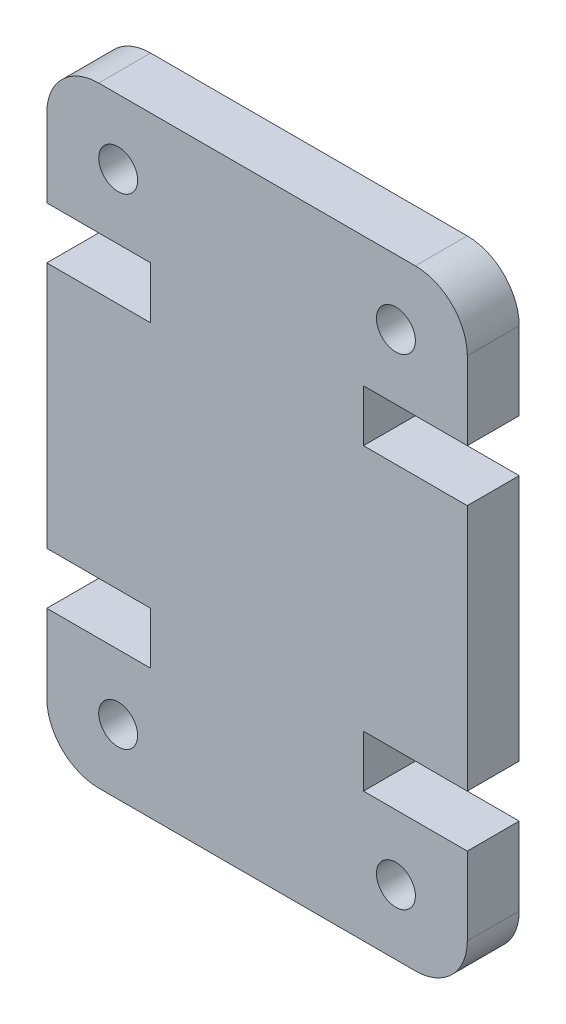
ISO-10303-21;
HEADER;
FILE_DESCRIPTION(('STEP AP214'),'2;1');
FILE_NAME('part.step','',(''),(''),'','','');
FILE_SCHEMA(('AUTOMOTIVE_DESIGN { 1 0 10303 214 1 1 1 1 }'));
ENDSEC;
DATA;
#1=APPLICATION_CONTEXT('core data for automotive mechanical design processes');
#2=APPLICATION_PROTOCOL_DEFINITION('international standard','automotive_design',2000,#1);
#3=PRODUCT_CONTEXT('',#1,'mechanical');
#4=PRODUCT('Part','Part','',(#3));
#5=PRODUCT_RELATED_PRODUCT_CATEGORY('part','',(#4));
#6=PRODUCT_DEFINITION_FORMATION('','',#4);
#7=PRODUCT_DEFINITION_CONTEXT('part definition',#1,'design');
#8=PRODUCT_DEFINITION('design','',#6,#7);
#9=PRODUCT_DEFINITION_SHAPE('','',#8);
#10=(LENGTH_UNIT() NAMED_UNIT(*) SI_UNIT(.MILLI.,.METRE.));
#11=(NAMED_UNIT(*) PLANE_ANGLE_UNIT() SI_UNIT($,.RADIAN.));
#12=(NAMED_UNIT(*) SI_UNIT($,.STERADIAN.) SOLID_ANGLE_UNIT());
#13=UNCERTAINTY_MEASURE_WITH_UNIT(LENGTH_MEASURE(1.E-05),#10,'distance_accuracy_value','');
#14=(GEOMETRIC_REPRESENTATION_CONTEXT(3) GLOBAL_UNCERTAINTY_ASSIGNED_CONTEXT((#13)) GLOBAL_UNIT_ASSIGNED_CONTEXT((#10,
#11,#12)) REPRESENTATION_CONTEXT('',''));
#15=CARTESIAN_POINT('',(0.,0.,0.));
#16=DIRECTION('',(0.,0.,1.));
#17=DIRECTION('',(1.,0.,0.));
#18=AXIS2_PLACEMENT_3D('',#15,#16,#17);
#19=CARTESIAN_POINT('',(14.2,2.,2.));
#20=DIRECTION('',(0.,0.,-1.));
#21=DIRECTION('',(-1.,0.,0.));
#22=AXIS2_PLACEMENT_3D('',#19,#20,#21);
#23=PLANE('',#22);
#24=CARTESIAN_POINT('',(13.4499999999986,21.0250000000001,2.));
#25=DIRECTION('',(0.,0.,1.));
#26=DIRECTION('',(1.,0.,0.));
#27=AXIS2_PLACEMENT_3D('',#24,#25,#26);
#28=CIRCLE('',#27,0.750000000000004);
#29=CARTESIAN_POINT('',(14.1999999999986,21.0250000000001,2.));
#30=VERTEX_POINT('',#29);
#31=EDGE_CURVE('E448',#30,#30,#28,.T.);
#32=ORIENTED_EDGE('',*,*,#31,.F.);
#33=EDGE_LOOP('',(#32));
#34=FACE_BOUND('',#33,.T.);
#35=CARTESIAN_POINT('',(13.4499999999986,2.4999999999999,2.));
#36=DIRECTION('',(0.,0.,1.));
#37=DIRECTION('',(-1.,0.,0.));
#38=AXIS2_PLACEMENT_3D('',#35,#36,#37);
#39=CIRCLE('',#38,0.750000000000004);
#40=CARTESIAN_POINT('',(12.6999999999986,2.4999999999999,2.));
#41=VERTEX_POINT('',#40);
#42=EDGE_CURVE('E230',#41,#41,#39,.T.);
#43=ORIENTED_EDGE('',*,*,#42,.F.);
#44=EDGE_LOOP('',(#43));
#45=FACE_BOUND('',#44,.T.);
#46=CARTESIAN_POINT('',(14.2,2.,2.));
#47=DIRECTION('',(0.,0.,1.));
#48=DIRECTION('',(-1.,0.,0.));
#49=AXIS2_PLACEMENT_3D('',#46,#47,#48);
#50=CIRCLE('',#49,2.);
#51=CARTESIAN_POINT('',(14.2,0.,2.));
#52=VERTEX_POINT('',#51);
#53=CARTESIAN_POINT('',(16.2,2.,2.));
#54=VERTEX_POINT('',#53);
#55=EDGE_CURVE('E273',#52,#54,#50,.T.);
#56=ORIENTED_EDGE('',*,*,#55,.T.);
#57=DIRECTION('',(0.,1.,0.));
#58=VECTOR('',#57,1.);
#59=CARTESIAN_POINT('',(16.2,5.00000000000014,2.));
#60=LINE('',#59,#58);
#61=CARTESIAN_POINT('',(16.2,5.00000000000014,2.));
#62=VERTEX_POINT('',#61);
#63=EDGE_CURVE('E141',#54,#62,#60,.T.);
#64=ORIENTED_EDGE('',*,*,#63,.T.);
#65=DIRECTION('',(-1.,0.,0.));
#66=VECTOR('',#65,1.);
#67=CARTESIAN_POINT('',(12.2,5.00000000000014,2.));
#68=LINE('',#67,#66);
#69=CARTESIAN_POINT('',(12.2,5.00000000000014,2.));
#70=VERTEX_POINT('',#69);
#71=EDGE_CURVE('E336',#62,#70,#68,.T.);
#72=ORIENTED_EDGE('',*,*,#71,.T.);
#73=DIRECTION('',(0.,1.,0.));
#74=VECTOR('',#73,1.);
#75=CARTESIAN_POINT('',(12.2,7.00000000000014,2.));
#76=LINE('',#75,#74);
#77=CARTESIAN_POINT('',(12.2,7.00000000000014,2.));
#78=VERTEX_POINT('',#77);
#79=EDGE_CURVE('E355',#70,#78,#76,.T.);
#80=ORIENTED_EDGE('',*,*,#79,.T.);
#81=DIRECTION('',(1.,0.,0.));
#82=VECTOR('',#81,1.);
#83=CARTESIAN_POINT('',(16.2,7.00000000000014,2.));
#84=LINE('',#83,#82);
#85=CARTESIAN_POINT('',(16.2,7.00000000000014,2.));
#86=VERTEX_POINT('',#85);
#87=EDGE_CURVE('E352',#78,#86,#84,.T.);
#88=ORIENTED_EDGE('',*,*,#87,.T.);
#89=DIRECTION('',(0.,1.,0.));
#90=VECTOR('',#89,1.);
#91=CARTESIAN_POINT('',(16.2,7.00000000000014,2.));
#92=LINE('',#91,#90);
#93=CARTESIAN_POINT('',(16.2,16.5249999999999,2.));
#94=VERTEX_POINT('',#93);
#95=EDGE_CURVE('E354',#86,#94,#92,.T.);
#96=ORIENTED_EDGE('',*,*,#95,.T.);
#97=DIRECTION('',(-1.,0.,0.));
#98=VECTOR('',#97,1.);
#99=CARTESIAN_POINT('',(16.2,16.5249999999999,2.));
#100=LINE('',#99,#98);
#101=CARTESIAN_POINT('',(12.2,16.5249999999999,2.));
#102=VERTEX_POINT('',#101);
#103=EDGE_CURVE('E357',#94,#102,#100,.T.);
#104=ORIENTED_EDGE('',*,*,#103,.T.);
#105=DIRECTION('',(0.,1.,0.));
#106=VECTOR('',#105,1.);
#107=CARTESIAN_POINT('',(12.2,16.5249999999999,2.));
#108=LINE('',#107,#106);
#109=CARTESIAN_POINT('',(12.2,18.5249999999999,2.));
#110=VERTEX_POINT('',#109);
#111=EDGE_CURVE('E363',#102,#110,#108,.T.);
#112=ORIENTED_EDGE('',*,*,#111,.T.);
#113=DIRECTION('',(1.,0.,0.));
#114=VECTOR('',#113,1.);
#115=CARTESIAN_POINT('',(12.2,18.5249999999999,2.));
#116=LINE('',#115,#114);
#117=CARTESIAN_POINT('',(16.2,18.5249999999999,2.));
#118=VERTEX_POINT('',#117);
#119=EDGE_CURVE('E365',#110,#118,#116,.T.);
#120=ORIENTED_EDGE('',*,*,#119,.T.);
#121=DIRECTION('',(0.,1.,0.));
#122=VECTOR('',#121,1.);
#123=CARTESIAN_POINT('',(16.2,18.5249999999999,2.));
#124=LINE('',#123,#122);
#125=CARTESIAN_POINT('',(16.2,21.525,2.));
#126=VERTEX_POINT('',#125);
#127=EDGE_CURVE('E367',#118,#126,#124,.T.);
#128=ORIENTED_EDGE('',*,*,#127,.T.);
#129=CARTESIAN_POINT('',(14.2,21.525,2.));
#130=DIRECTION('',(0.,0.,1.));
#131=DIRECTION('',(1.,0.,0.));
#132=AXIS2_PLACEMENT_3D('',#129,#130,#131);
#133=CIRCLE('',#132,2.);
#134=CARTESIAN_POINT('',(14.2,23.525,2.));
#135=VERTEX_POINT('',#134);
#136=EDGE_CURVE('E369',#126,#135,#133,.T.);
#137=ORIENTED_EDGE('',*,*,#136,.T.);
#138=DIRECTION('',(-1.,0.,0.));
#139=VECTOR('',#138,1.);
#140=CARTESIAN_POINT('',(1.99999999999999,23.525,2.));
#141=LINE('',#140,#139);
#142=CARTESIAN_POINT('',(1.99999999999999,23.525,2.));
#143=VERTEX_POINT('',#142);
#144=EDGE_CURVE('E371',#135,#143,#141,.T.);
#145=ORIENTED_EDGE('',*,*,#144,.T.);
#146=CARTESIAN_POINT('',(2.,21.525,2.));
#147=DIRECTION('',(0.,0.,1.));
#148=DIRECTION('',(-1.,0.,0.));
#149=AXIS2_PLACEMENT_3D('',#146,#147,#148);
#150=CIRCLE('',#149,2.);
#151=CARTESIAN_POINT('',(0.,21.525,2.));
#152=VERTEX_POINT('',#151);
#153=EDGE_CURVE('E373',#143,#152,#150,.T.);
#154=ORIENTED_EDGE('',*,*,#153,.T.);
#155=DIRECTION('',(0.,-1.,0.));
#156=VECTOR('',#155,1.);
#157=CARTESIAN_POINT('',(0.,18.5249999999999,2.));
#158=LINE('',#157,#156);
#159=CARTESIAN_POINT('',(0.,18.5249999999999,2.));
#160=VERTEX_POINT('',#159);
#161=EDGE_CURVE('E375',#152,#160,#158,.T.);
#162=ORIENTED_EDGE('',*,*,#161,.T.);
#163=DIRECTION('',(1.,0.,0.));
#164=VECTOR('',#163,1.);
#165=CARTESIAN_POINT('',(4.,18.5249999999999,2.));
#166=LINE('',#165,#164);
#167=CARTESIAN_POINT('',(4.,18.5249999999999,2.));
#168=VERTEX_POINT('',#167);
#169=EDGE_CURVE('E377',#160,#168,#166,.T.);
#170=ORIENTED_EDGE('',*,*,#169,.T.);
#171=DIRECTION('',(0.,-1.,0.));
#172=VECTOR('',#171,1.);
#173=CARTESIAN_POINT('',(4.,16.5249999999999,2.));
#174=LINE('',#173,#172);
#175=CARTESIAN_POINT('',(4.,16.5249999999999,2.));
#176=VERTEX_POINT('',#175);
#177=EDGE_CURVE('E379',#168,#176,#174,.T.);
#178=ORIENTED_EDGE('',*,*,#177,.T.);
#179=DIRECTION('',(-1.,0.,0.));
#180=VECTOR('',#179,1.);
#181=CARTESIAN_POINT('',(0.,16.5249999999999,2.));
#182=LINE('',#181,#180);
#183=CARTESIAN_POINT('',(0.,16.5249999999999,2.));
#184=VERTEX_POINT('',#183);
#185=EDGE_CURVE('E381',#176,#184,#182,.T.);
#186=ORIENTED_EDGE('',*,*,#185,.T.);
#187=DIRECTION('',(0.,-1.,0.));
#188=VECTOR('',#187,1.);
#189=CARTESIAN_POINT('',(0.,7.00000000000012,2.));
#190=LINE('',#189,#188);
#191=CARTESIAN_POINT('',(0.,7.00000000000012,2.));
#192=VERTEX_POINT('',#191);
#193=EDGE_CURVE('E383',#184,#192,#190,.T.);
#194=ORIENTED_EDGE('',*,*,#193,.T.);
#195=DIRECTION('',(1.,0.,0.));
#196=VECTOR('',#195,1.);
#197=CARTESIAN_POINT('',(0.,7.00000000000012,2.));
#198=LINE('',#197,#196);
#199=CARTESIAN_POINT('',(4.,7.00000000000014,2.));
#200=VERTEX_POINT('',#199);
#201=EDGE_CURVE('E385',#192,#200,#198,.T.);
#202=ORIENTED_EDGE('',*,*,#201,.T.);
#203=DIRECTION('',(0.,-1.,0.));
#204=VECTOR('',#203,1.);
#205=CARTESIAN_POINT('',(4.,7.00000000000014,2.));
#206=LINE('',#205,#204);
#207=CARTESIAN_POINT('',(4.,5.00000000000014,2.));
#208=VERTEX_POINT('',#207);
#209=EDGE_CURVE('E387',#200,#208,#206,.T.);
#210=ORIENTED_EDGE('',*,*,#209,.T.);
#211=DIRECTION('',(-1.,0.,0.));
#212=VECTOR('',#211,1.);
#213=CARTESIAN_POINT('',(4.,5.00000000000014,2.));
#214=LINE('',#213,#212);
#215=CARTESIAN_POINT('',(0.,5.00000000000014,2.));
#216=VERTEX_POINT('',#215);
#217=EDGE_CURVE('E208',#208,#216,#214,.T.);
#218=ORIENTED_EDGE('',*,*,#217,.T.);
#219=DIRECTION('',(0.,-1.,0.));
#220=VECTOR('',#219,1.);
#221=CARTESIAN_POINT('',(0.,5.00000000000014,2.));
#222=LINE('',#221,#220);
#223=CARTESIAN_POINT('',(0.,2.00000000000002,2.));
#224=VERTEX_POINT('',#223);
#225=EDGE_CURVE('E202',#216,#224,#222,.T.);
#226=ORIENTED_EDGE('',*,*,#225,.T.);
#227=CARTESIAN_POINT('',(2.,2.,2.));
#228=DIRECTION('',(0.,0.,1.));
#229=DIRECTION('',(1.,0.,0.));
#230=AXIS2_PLACEMENT_3D('',#227,#228,#229);
#231=CIRCLE('',#230,2.);
#232=CARTESIAN_POINT('',(2.,0.,2.));
#233=VERTEX_POINT('',#232);
#234=EDGE_CURVE('E206',#224,#233,#231,.T.);
#235=ORIENTED_EDGE('',*,*,#234,.T.);
#236=DIRECTION('',(1.,0.,0.));
#237=VECTOR('',#236,1.);
#238=CARTESIAN_POINT('',(2.,0.,2.));
#239=LINE('',#238,#237);
#240=EDGE_CURVE('E50',#233,#52,#239,.T.);
#241=ORIENTED_EDGE('',*,*,#240,.T.);
#242=EDGE_LOOP('',(#56,#64,#72,#80,#88,#96,#104,#112,#120,#128,#137,#145,#154,#162,#170,#178,
#186,#194,#202,#210,#218,#226,#235,#241));
#243=FACE_BOUND('',#242,.T.);
#244=CARTESIAN_POINT('',(2.75000000000137,21.0250000000001,2.));
#245=DIRECTION('',(0.,0.,1.));
#246=DIRECTION('',(-1.,0.,0.));
#247=AXIS2_PLACEMENT_3D('',#244,#245,#246);
#248=CIRCLE('',#247,0.749999999999999);
#249=CARTESIAN_POINT('',(2.00000000000137,21.0250000000001,2.));
#250=VERTEX_POINT('',#249);
#251=EDGE_CURVE('E454',#250,#250,#248,.T.);
#252=ORIENTED_EDGE('',*,*,#251,.F.);
#253=EDGE_LOOP('',(#252));
#254=FACE_BOUND('',#253,.T.);
#255=CARTESIAN_POINT('',(2.75000000000138,2.4999999999999,2.));
#256=DIRECTION('',(0.,0.,1.));
#257=DIRECTION('',(1.,0.,0.));
#258=AXIS2_PLACEMENT_3D('',#255,#256,#257);
#259=CIRCLE('',#258,0.75);
#260=CARTESIAN_POINT('',(3.50000000000138,2.4999999999999,2.));
#261=VERTEX_POINT('',#260);
#262=EDGE_CURVE('E439',#261,#261,#259,.T.);
#263=ORIENTED_EDGE('',*,*,#262,.F.);
#264=EDGE_LOOP('',(#263));
#265=FACE_BOUND('',#264,.T.);
#266=ADVANCED_FACE('F33',(#34,#45,#243,#254,#265),#23,.F.);
#267=CARTESIAN_POINT('',(14.2,2.,0.));
#268=DIRECTION('',(0.,0.,-1.));
#269=DIRECTION('',(-1.,0.,0.));
#270=AXIS2_PLACEMENT_3D('',#267,#268,#269);
#271=PLANE('',#270);
#272=CARTESIAN_POINT('',(13.4499999999986,21.0250000000001,0.));
#273=DIRECTION('',(0.,0.,1.));
#274=DIRECTION('',(1.,0.,0.));
#275=AXIS2_PLACEMENT_3D('',#272,#273,#274);
#276=CIRCLE('',#275,0.750000000000004);
#277=CARTESIAN_POINT('',(14.1999999999986,21.0250000000001,0.));
#278=VERTEX_POINT('',#277);
#279=EDGE_CURVE('E445',#278,#278,#276,.T.);
#280=ORIENTED_EDGE('',*,*,#279,.T.);
#281=EDGE_LOOP('',(#280));
#282=FACE_BOUND('',#281,.T.);
#283=CARTESIAN_POINT('',(13.4499999999986,2.4999999999999,0.));
#284=DIRECTION('',(0.,0.,1.));
#285=DIRECTION('',(-1.,0.,0.));
#286=AXIS2_PLACEMENT_3D('',#283,#284,#285);
#287=CIRCLE('',#286,0.750000000000004);
#288=CARTESIAN_POINT('',(12.6999999999986,2.4999999999999,0.));
#289=VERTEX_POINT('',#288);
#290=EDGE_CURVE('E457',#289,#289,#287,.T.);
#291=ORIENTED_EDGE('',*,*,#290,.T.);
#292=EDGE_LOOP('',(#291));
#293=FACE_BOUND('',#292,.T.);
#294=CARTESIAN_POINT('',(14.2,2.,0.));
#295=DIRECTION('',(0.,0.,1.));
#296=DIRECTION('',(-1.,0.,0.));
#297=AXIS2_PLACEMENT_3D('',#294,#295,#296);
#298=CIRCLE('',#297,2.);
#299=CARTESIAN_POINT('',(14.2,0.,0.));
#300=VERTEX_POINT('',#299);
#301=CARTESIAN_POINT('',(16.2,2.,0.));
#302=VERTEX_POINT('',#301);
#303=EDGE_CURVE('E226',#300,#302,#298,.T.);
#304=ORIENTED_EDGE('',*,*,#303,.F.);
#305=DIRECTION('',(1.,0.,0.));
#306=VECTOR('',#305,1.);
#307=CARTESIAN_POINT('',(2.,0.,0.));
#308=LINE('',#307,#306);
#309=CARTESIAN_POINT('',(2.,0.,0.));
#310=VERTEX_POINT('',#309);
#311=EDGE_CURVE('E133',#310,#300,#308,.T.);
#312=ORIENTED_EDGE('',*,*,#311,.F.);
#313=CARTESIAN_POINT('',(2.,2.,0.));
#314=DIRECTION('',(0.,0.,1.));
#315=DIRECTION('',(1.,0.,0.));
#316=AXIS2_PLACEMENT_3D('',#313,#314,#315);
#317=CIRCLE('',#316,2.);
#318=CARTESIAN_POINT('',(0.,2.00000000000002,0.));
#319=VERTEX_POINT('',#318);
#320=EDGE_CURVE('E127',#319,#310,#317,.T.);
#321=ORIENTED_EDGE('',*,*,#320,.F.);
#322=DIRECTION('',(0.,-1.,0.));
#323=VECTOR('',#322,1.);
#324=CARTESIAN_POINT('',(0.,5.00000000000014,0.));
#325=LINE('',#324,#323);
#326=CARTESIAN_POINT('',(0.,5.00000000000014,0.));
#327=VERTEX_POINT('',#326);
#328=EDGE_CURVE('E216',#327,#319,#325,.T.);
#329=ORIENTED_EDGE('',*,*,#328,.F.);
#330=DIRECTION('',(-1.,0.,0.));
#331=VECTOR('',#330,1.);
#332=CARTESIAN_POINT('',(4.,5.00000000000014,0.));
#333=LINE('',#332,#331);
#334=CARTESIAN_POINT('',(4.,5.00000000000014,0.));
#335=VERTEX_POINT('',#334);
#336=EDGE_CURVE('E268',#335,#327,#333,.T.);
#337=ORIENTED_EDGE('',*,*,#336,.F.);
#338=DIRECTION('',(0.,-1.,0.));
#339=VECTOR('',#338,1.);
#340=CARTESIAN_POINT('',(4.,7.00000000000014,0.));
#341=LINE('',#340,#339);
#342=CARTESIAN_POINT('',(4.,7.00000000000014,0.));
#343=VERTEX_POINT('',#342);
#344=EDGE_CURVE('E266',#343,#335,#341,.T.);
#345=ORIENTED_EDGE('',*,*,#344,.F.);
#346=DIRECTION('',(1.,0.,0.));
#347=VECTOR('',#346,1.);
#348=CARTESIAN_POINT('',(0.,7.00000000000012,0.));
#349=LINE('',#348,#347);
#350=CARTESIAN_POINT('',(0.,7.00000000000012,0.));
#351=VERTEX_POINT('',#350);
#352=EDGE_CURVE('E264',#351,#343,#349,.T.);
#353=ORIENTED_EDGE('',*,*,#352,.F.);
#354=DIRECTION('',(0.,-1.,0.));
#355=VECTOR('',#354,1.);
#356=CARTESIAN_POINT('',(0.,7.00000000000012,0.));
#357=LINE('',#356,#355);
#358=CARTESIAN_POINT('',(0.,16.5249999999999,0.));
#359=VERTEX_POINT('',#358);
#360=EDGE_CURVE('E262',#359,#351,#357,.T.);
#361=ORIENTED_EDGE('',*,*,#360,.F.);
#362=DIRECTION('',(-1.,0.,0.));
#363=VECTOR('',#362,1.);
#364=CARTESIAN_POINT('',(0.,16.5249999999999,0.));
#365=LINE('',#364,#363);
#366=CARTESIAN_POINT('',(4.,16.5249999999999,0.));
#367=VERTEX_POINT('',#366);
#368=EDGE_CURVE('E260',#367,#359,#365,.T.);
#369=ORIENTED_EDGE('',*,*,#368,.F.);
#370=DIRECTION('',(0.,-1.,0.));
#371=VECTOR('',#370,1.);
#372=CARTESIAN_POINT('',(4.,16.5249999999999,0.));
#373=LINE('',#372,#371);
#374=CARTESIAN_POINT('',(4.,18.5249999999999,0.));
#375=VERTEX_POINT('',#374);
#376=EDGE_CURVE('E258',#375,#367,#373,.T.);
#377=ORIENTED_EDGE('',*,*,#376,.F.);
#378=DIRECTION('',(1.,0.,0.));
#379=VECTOR('',#378,1.);
#380=CARTESIAN_POINT('',(4.,18.5249999999999,0.));
#381=LINE('',#380,#379);
#382=CARTESIAN_POINT('',(0.,18.5249999999999,0.));
#383=VERTEX_POINT('',#382);
#384=EDGE_CURVE('E256',#383,#375,#381,.T.);
#385=ORIENTED_EDGE('',*,*,#384,.F.);
#386=DIRECTION('',(0.,-1.,0.));
#387=VECTOR('',#386,1.);
#388=CARTESIAN_POINT('',(0.,18.5249999999999,0.));
#389=LINE('',#388,#387);
#390=CARTESIAN_POINT('',(0.,21.525,0.));
#391=VERTEX_POINT('',#390);
#392=EDGE_CURVE('E254',#391,#383,#389,.T.);
#393=ORIENTED_EDGE('',*,*,#392,.F.);
#394=CARTESIAN_POINT('',(2.,21.525,0.));
#395=DIRECTION('',(0.,0.,1.));
#396=DIRECTION('',(-1.,0.,0.));
#397=AXIS2_PLACEMENT_3D('',#394,#395,#396);
#398=CIRCLE('',#397,2.);
#399=CARTESIAN_POINT('',(1.99999999999999,23.525,0.));
#400=VERTEX_POINT('',#399);
#401=EDGE_CURVE('E252',#400,#391,#398,.T.);
#402=ORIENTED_EDGE('',*,*,#401,.F.);
#403=DIRECTION('',(-1.,0.,0.));
#404=VECTOR('',#403,1.);
#405=CARTESIAN_POINT('',(1.99999999999999,23.525,0.));
#406=LINE('',#405,#404);
#407=CARTESIAN_POINT('',(14.2,23.525,0.));
#408=VERTEX_POINT('',#407);
#409=EDGE_CURVE('E250',#408,#400,#406,.T.);
#410=ORIENTED_EDGE('',*,*,#409,.F.);
#411=CARTESIAN_POINT('',(14.2,21.525,0.));
#412=DIRECTION('',(0.,0.,1.));
#413=DIRECTION('',(1.,0.,0.));
#414=AXIS2_PLACEMENT_3D('',#411,#412,#413);
#415=CIRCLE('',#414,2.);
#416=CARTESIAN_POINT('',(16.2,21.525,0.));
#417=VERTEX_POINT('',#416);
#418=EDGE_CURVE('E248',#417,#408,#415,.T.);
#419=ORIENTED_EDGE('',*,*,#418,.F.);
#420=DIRECTION('',(0.,1.,0.));
#421=VECTOR('',#420,1.);
#422=CARTESIAN_POINT('',(16.2,18.5249999999999,0.));
#423=LINE('',#422,#421);
#424=CARTESIAN_POINT('',(16.2,18.5249999999999,0.));
#425=VERTEX_POINT('',#424);
#426=EDGE_CURVE('E246',#425,#417,#423,.T.);
#427=ORIENTED_EDGE('',*,*,#426,.F.);
#428=DIRECTION('',(1.,0.,0.));
#429=VECTOR('',#428,1.);
#430=CARTESIAN_POINT('',(12.2,18.5249999999999,0.));
#431=LINE('',#430,#429);
#432=CARTESIAN_POINT('',(12.2,18.5249999999999,0.));
#433=VERTEX_POINT('',#432);
#434=EDGE_CURVE('E244',#433,#425,#431,.T.);
#435=ORIENTED_EDGE('',*,*,#434,.F.);
#436=DIRECTION('',(0.,1.,0.));
#437=VECTOR('',#436,1.);
#438=CARTESIAN_POINT('',(12.2,16.5249999999999,0.));
#439=LINE('',#438,#437);
#440=CARTESIAN_POINT('',(12.2,16.5249999999999,0.));
#441=VERTEX_POINT('',#440);
#442=EDGE_CURVE('E242',#441,#433,#439,.T.);
#443=ORIENTED_EDGE('',*,*,#442,.F.);
#444=DIRECTION('',(-1.,0.,0.));
#445=VECTOR('',#444,1.);
#446=CARTESIAN_POINT('',(16.2,16.5249999999999,0.));
#447=LINE('',#446,#445);
#448=CARTESIAN_POINT('',(16.2,16.5249999999999,0.));
#449=VERTEX_POINT('',#448);
#450=EDGE_CURVE('E240',#449,#441,#447,.T.);
#451=ORIENTED_EDGE('',*,*,#450,.F.);
#452=DIRECTION('',(0.,1.,0.));
#453=VECTOR('',#452,1.);
#454=CARTESIAN_POINT('',(16.2,7.00000000000014,0.));
#455=LINE('',#454,#453);
#456=CARTESIAN_POINT('',(16.2,7.00000000000014,0.));
#457=VERTEX_POINT('',#456);
#458=EDGE_CURVE('E238',#457,#449,#455,.T.);
#459=ORIENTED_EDGE('',*,*,#458,.F.);
#460=DIRECTION('',(1.,0.,0.));
#461=VECTOR('',#460,1.);
#462=CARTESIAN_POINT('',(16.2,7.00000000000014,0.));
#463=LINE('',#462,#461);
#464=CARTESIAN_POINT('',(12.2,7.00000000000014,0.));
#465=VERTEX_POINT('',#464);
#466=EDGE_CURVE('E236',#465,#457,#463,.T.);
#467=ORIENTED_EDGE('',*,*,#466,.F.);
#468=DIRECTION('',(0.,1.,0.));
#469=VECTOR('',#468,1.);
#470=CARTESIAN_POINT('',(12.2,7.00000000000014,0.));
#471=LINE('',#470,#469);
#472=CARTESIAN_POINT('',(12.2,5.00000000000014,0.));
#473=VERTEX_POINT('',#472);
#474=EDGE_CURVE('E234',#473,#465,#471,.T.);
#475=ORIENTED_EDGE('',*,*,#474,.F.);
#476=DIRECTION('',(-1.,0.,0.));
#477=VECTOR('',#476,1.);
#478=CARTESIAN_POINT('',(12.2,5.00000000000014,0.));
#479=LINE('',#478,#477);
#480=CARTESIAN_POINT('',(16.2,5.00000000000014,0.));
#481=VERTEX_POINT('',#480);
#482=EDGE_CURVE('E232',#481,#473,#479,.T.);
#483=ORIENTED_EDGE('',*,*,#482,.F.);
#484=DIRECTION('',(0.,1.,0.));
#485=VECTOR('',#484,1.);
#486=CARTESIAN_POINT('',(16.2,5.00000000000014,0.));
#487=LINE('',#486,#485);
#488=EDGE_CURVE('E229',#302,#481,#487,.T.);
#489=ORIENTED_EDGE('',*,*,#488,.F.);
#490=EDGE_LOOP('',(#304,#312,#321,#329,#337,#345,#353,#361,#369,#377,#385,#393,#402,#410,#419,
#427,#435,#443,#451,#459,#467,#475,#483,#489));
#491=FACE_BOUND('',#490,.T.);
#492=CARTESIAN_POINT('',(2.75000000000137,21.0250000000001,0.));
#493=DIRECTION('',(0.,0.,1.));
#494=DIRECTION('',(-1.,0.,0.));
#495=AXIS2_PLACEMENT_3D('',#492,#493,#494);
#496=CIRCLE('',#495,0.749999999999999);
#497=CARTESIAN_POINT('',(2.00000000000137,21.0250000000001,0.));
#498=VERTEX_POINT('',#497);
#499=EDGE_CURVE('E451',#498,#498,#496,.T.);
#500=ORIENTED_EDGE('',*,*,#499,.T.);
#501=EDGE_LOOP('',(#500));
#502=FACE_BOUND('',#501,.T.);
#503=CARTESIAN_POINT('',(2.75000000000138,2.4999999999999,0.));
#504=DIRECTION('',(0.,0.,1.));
#505=DIRECTION('',(1.,0.,0.));
#506=AXIS2_PLACEMENT_3D('',#503,#504,#505);
#507=CIRCLE('',#506,0.75);
#508=CARTESIAN_POINT('',(3.50000000000138,2.4999999999999,0.));
#509=VERTEX_POINT('',#508);
#510=EDGE_CURVE('E442',#509,#509,#507,.T.);
#511=ORIENTED_EDGE('',*,*,#510,.T.);
#512=EDGE_LOOP('',(#511));
#513=FACE_BOUND('',#512,.T.);
#514=ADVANCED_FACE('F340',(#282,#293,#491,#502,#513),#271,.T.);
#515=CARTESIAN_POINT('',(14.2,2.,2.));
#516=DIRECTION('',(0.,0.,-1.));
#517=DIRECTION('',(-1.,0.,0.));
#518=AXIS2_PLACEMENT_3D('',#515,#516,#517);
#519=CYLINDRICAL_SURFACE('',#518,2.);
#520=ORIENTED_EDGE('',*,*,#303,.T.);
#521=DIRECTION('',(0.,0.,-1.));
#522=VECTOR('',#521,1.);
#523=CARTESIAN_POINT('',(16.2,2.,2.));
#524=LINE('',#523,#522);
#525=EDGE_CURVE('E11',#54,#302,#524,.T.);
#526=ORIENTED_EDGE('',*,*,#525,.F.);
#527=ORIENTED_EDGE('',*,*,#55,.F.);
#528=DIRECTION('',(0.,0.,-1.));
#529=VECTOR('',#528,1.);
#530=CARTESIAN_POINT('',(14.2,0.,2.));
#531=LINE('',#530,#529);
#532=EDGE_CURVE('E222',#52,#300,#531,.T.);
#533=ORIENTED_EDGE('',*,*,#532,.T.);
#534=EDGE_LOOP('',(#520,#526,#527,#533));
#535=FACE_BOUND('',#534,.T.);
#536=ADVANCED_FACE('F35',(#535),#519,.T.);
#537=CARTESIAN_POINT('',(16.2,5.00000000000014,2.));
#538=DIRECTION('',(-1.,0.,0.));
#539=DIRECTION('',(0.,-1.,0.));
#540=AXIS2_PLACEMENT_3D('',#537,#538,#539);
#541=PLANE('',#540);
#542=ORIENTED_EDGE('',*,*,#488,.T.);
#543=DIRECTION('',(0.,0.,-1.));
#544=VECTOR('',#543,1.);
#545=CARTESIAN_POINT('',(16.2,5.00000000000014,2.));
#546=LINE('',#545,#544);
#547=EDGE_CURVE('E42',#62,#481,#546,.T.);
#548=ORIENTED_EDGE('',*,*,#547,.F.);
#549=ORIENTED_EDGE('',*,*,#63,.F.);
#550=ORIENTED_EDGE('',*,*,#525,.T.);
#551=EDGE_LOOP('',(#542,#548,#549,#550));
#552=FACE_BOUND('',#551,.T.);
#553=ADVANCED_FACE('F686',(#552),#541,.F.);
#554=CARTESIAN_POINT('',(12.2,5.00000000000014,2.));
#555=DIRECTION('',(0.,-1.,0.));
#556=DIRECTION('',(0.,0.,-1.));
#557=AXIS2_PLACEMENT_3D('',#554,#555,#556);
#558=PLANE('',#557);
#559=ORIENTED_EDGE('',*,*,#482,.T.);
#560=DIRECTION('',(0.,0.,-1.));
#561=VECTOR('',#560,1.);
#562=CARTESIAN_POINT('',(12.2,5.00000000000014,2.));
#563=LINE('',#562,#561);
#564=EDGE_CURVE('E328',#70,#473,#563,.T.);
#565=ORIENTED_EDGE('',*,*,#564,.F.);
#566=ORIENTED_EDGE('',*,*,#71,.F.);
#567=ORIENTED_EDGE('',*,*,#547,.T.);
#568=EDGE_LOOP('',(#559,#565,#566,#567));
#569=FACE_BOUND('',#568,.T.);
#570=ADVANCED_FACE('F334',(#569),#558,.F.);
#571=CARTESIAN_POINT('',(12.2,7.00000000000014,2.));
#572=DIRECTION('',(-1.,0.,0.));
#573=DIRECTION('',(0.,-1.,0.));
#574=AXIS2_PLACEMENT_3D('',#571,#572,#573);
#575=PLANE('',#574);
#576=ORIENTED_EDGE('',*,*,#474,.T.);
#577=DIRECTION('',(0.,0.,-1.));
#578=VECTOR('',#577,1.);
#579=CARTESIAN_POINT('',(12.2,7.00000000000014,2.));
#580=LINE('',#579,#578);
#581=EDGE_CURVE('E325',#78,#465,#580,.T.);
#582=ORIENTED_EDGE('',*,*,#581,.F.);
#583=ORIENTED_EDGE('',*,*,#79,.F.);
#584=ORIENTED_EDGE('',*,*,#564,.T.);
#585=EDGE_LOOP('',(#576,#582,#583,#584));
#586=FACE_BOUND('',#585,.T.);
#587=ADVANCED_FACE('F346',(#586),#575,.F.);
#588=CARTESIAN_POINT('',(16.2,7.00000000000014,2.));
#589=DIRECTION('',(0.,1.,0.));
#590=DIRECTION('',(-1.,0.,0.));
#591=AXIS2_PLACEMENT_3D('',#588,#589,#590);
#592=PLANE('',#591);
#593=ORIENTED_EDGE('',*,*,#466,.T.);
#594=DIRECTION('',(0.,0.,-1.));
#595=VECTOR('',#594,1.);
#596=CARTESIAN_POINT('',(16.2,7.00000000000014,2.));
#597=LINE('',#596,#595);
#598=EDGE_CURVE('E322',#86,#457,#597,.T.);
#599=ORIENTED_EDGE('',*,*,#598,.F.);
#600=ORIENTED_EDGE('',*,*,#87,.F.);
#601=ORIENTED_EDGE('',*,*,#581,.T.);
#602=EDGE_LOOP('',(#593,#599,#600,#601));
#603=FACE_BOUND('',#602,.T.);
#604=ADVANCED_FACE('F350',(#603),#592,.F.);
#605=CARTESIAN_POINT('',(16.2,7.00000000000014,2.));
#606=DIRECTION('',(-1.,0.,0.));
#607=DIRECTION('',(0.,0.,1.));
#608=AXIS2_PLACEMENT_3D('',#605,#606,#607);
#609=PLANE('',#608);
#610=ORIENTED_EDGE('',*,*,#458,.T.);
#611=DIRECTION('',(0.,0.,-1.));
#612=VECTOR('',#611,1.);
#613=CARTESIAN_POINT('',(16.2,16.5249999999999,2.));
#614=LINE('',#613,#612);
#615=EDGE_CURVE('E319',#94,#449,#614,.T.);
#616=ORIENTED_EDGE('',*,*,#615,.F.);
#617=ORIENTED_EDGE('',*,*,#95,.F.);
#618=ORIENTED_EDGE('',*,*,#598,.T.);
#619=EDGE_LOOP('',(#610,#616,#617,#618));
#620=FACE_BOUND('',#619,.T.);
#621=ADVANCED_FACE('F651',(#620),#609,.F.);
#622=CARTESIAN_POINT('',(16.2,16.5249999999999,2.));
#623=DIRECTION('',(0.,-1.,0.));
#624=DIRECTION('',(1.,0.,0.));
#625=AXIS2_PLACEMENT_3D('',#622,#623,#624);
#626=PLANE('',#625);
#627=ORIENTED_EDGE('',*,*,#450,.T.);
#628=DIRECTION('',(0.,0.,-1.));
#629=VECTOR('',#628,1.);
#630=CARTESIAN_POINT('',(12.2,16.5249999999999,2.));
#631=LINE('',#630,#629);
#632=EDGE_CURVE('E316',#102,#441,#631,.T.);
#633=ORIENTED_EDGE('',*,*,#632,.F.);
#634=ORIENTED_EDGE('',*,*,#103,.F.);
#635=ORIENTED_EDGE('',*,*,#615,.T.);
#636=EDGE_LOOP('',(#627,#633,#634,#635));
#637=FACE_BOUND('',#636,.T.);
#638=ADVANCED_FACE('F641',(#637),#626,.F.);
#639=CARTESIAN_POINT('',(12.2,16.5249999999999,2.));
#640=DIRECTION('',(-1.,0.,0.));
#641=DIRECTION('',(0.,-1.,0.));
#642=AXIS2_PLACEMENT_3D('',#639,#640,#641);
#643=PLANE('',#642);
#644=ORIENTED_EDGE('',*,*,#442,.T.);
#645=DIRECTION('',(0.,0.,-1.));
#646=VECTOR('',#645,1.);
#647=CARTESIAN_POINT('',(12.2,18.5249999999999,2.));
#648=LINE('',#647,#646);
#649=EDGE_CURVE('E313',#110,#433,#648,.T.);
#650=ORIENTED_EDGE('',*,*,#649,.F.);
#651=ORIENTED_EDGE('',*,*,#111,.F.);
#652=ORIENTED_EDGE('',*,*,#632,.T.);
#653=EDGE_LOOP('',(#644,#650,#651,#652));
#654=FACE_BOUND('',#653,.T.);
#655=ADVANCED_FACE('F631',(#654),#643,.F.);
#656=CARTESIAN_POINT('',(12.2,18.5249999999999,2.));
#657=DIRECTION('',(0.,1.,0.));
#658=DIRECTION('',(0.,0.,1.));
#659=AXIS2_PLACEMENT_3D('',#656,#657,#658);
#660=PLANE('',#659);
#661=ORIENTED_EDGE('',*,*,#434,.T.);
#662=DIRECTION('',(0.,0.,-1.));
#663=VECTOR('',#662,1.);
#664=CARTESIAN_POINT('',(16.2,18.5249999999999,2.));
#665=LINE('',#664,#663);
#666=EDGE_CURVE('E310',#118,#425,#665,.T.);
#667=ORIENTED_EDGE('',*,*,#666,.F.);
#668=ORIENTED_EDGE('',*,*,#119,.F.);
#669=ORIENTED_EDGE('',*,*,#649,.T.);
#670=EDGE_LOOP('',(#661,#667,#668,#669));
#671=FACE_BOUND('',#670,.T.);
#672=ADVANCED_FACE('F621',(#671),#660,.F.);
#673=CARTESIAN_POINT('',(16.2,18.5249999999999,2.));
#674=DIRECTION('',(-1.,0.,0.));
#675=DIRECTION('',(0.,-1.,0.));
#676=AXIS2_PLACEMENT_3D('',#673,#674,#675);
#677=PLANE('',#676);
#678=ORIENTED_EDGE('',*,*,#426,.T.);
#679=DIRECTION('',(0.,0.,-1.));
#680=VECTOR('',#679,1.);
#681=CARTESIAN_POINT('',(16.2,21.525,2.));
#682=LINE('',#681,#680);
#683=EDGE_CURVE('E307',#126,#417,#682,.T.);
#684=ORIENTED_EDGE('',*,*,#683,.F.);
#685=ORIENTED_EDGE('',*,*,#127,.F.);
#686=ORIENTED_EDGE('',*,*,#666,.T.);
#687=EDGE_LOOP('',(#678,#684,#685,#686));
#688=FACE_BOUND('',#687,.T.);
#689=ADVANCED_FACE('F611',(#688),#677,.F.);
#690=CARTESIAN_POINT('',(14.2,21.525,2.));
#691=DIRECTION('',(0.,0.,-1.));
#692=DIRECTION('',(-1.,0.,0.));
#693=AXIS2_PLACEMENT_3D('',#690,#691,#692);
#694=CYLINDRICAL_SURFACE('',#693,2.);
#695=ORIENTED_EDGE('',*,*,#418,.T.);
#696=DIRECTION('',(0.,0.,-1.));
#697=VECTOR('',#696,1.);
#698=CARTESIAN_POINT('',(14.2,23.525,2.));
#699=LINE('',#698,#697);
#700=EDGE_CURVE('E304',#135,#408,#699,.T.);
#701=ORIENTED_EDGE('',*,*,#700,.F.);
#702=ORIENTED_EDGE('',*,*,#136,.F.);
#703=ORIENTED_EDGE('',*,*,#683,.T.);
#704=EDGE_LOOP('',(#695,#701,#702,#703));
#705=FACE_BOUND('',#704,.T.);
#706=ADVANCED_FACE('F601',(#705),#694,.T.);
#707=CARTESIAN_POINT('',(1.99999999999999,23.525,2.));
#708=DIRECTION('',(0.,-1.,0.));
#709=DIRECTION('',(0.,0.,-1.));
#710=AXIS2_PLACEMENT_3D('',#707,#708,#709);
#711=PLANE('',#710);
#712=ORIENTED_EDGE('',*,*,#409,.T.);
#713=DIRECTION('',(0.,0.,-1.));
#714=VECTOR('',#713,1.);
#715=CARTESIAN_POINT('',(1.99999999999999,23.525,2.));
#716=LINE('',#715,#714);
#717=EDGE_CURVE('E301',#143,#400,#716,.T.);
#718=ORIENTED_EDGE('',*,*,#717,.F.);
#719=ORIENTED_EDGE('',*,*,#144,.F.);
#720=ORIENTED_EDGE('',*,*,#700,.T.);
#721=EDGE_LOOP('',(#712,#718,#719,#720));
#722=FACE_BOUND('',#721,.T.);
#723=ADVANCED_FACE('F591',(#722),#711,.F.);
#724=CARTESIAN_POINT('',(2.,21.525,2.));
#725=DIRECTION('',(0.,0.,-1.));
#726=DIRECTION('',(-1.,0.,0.));
#727=AXIS2_PLACEMENT_3D('',#724,#725,#726);
#728=CYLINDRICAL_SURFACE('',#727,2.);
#729=ORIENTED_EDGE('',*,*,#401,.T.);
#730=DIRECTION('',(0.,0.,-1.));
#731=VECTOR('',#730,1.);
#732=CARTESIAN_POINT('',(0.,21.525,2.));
#733=LINE('',#732,#731);
#734=EDGE_CURVE('E298',#152,#391,#733,.T.);
#735=ORIENTED_EDGE('',*,*,#734,.F.);
#736=ORIENTED_EDGE('',*,*,#153,.F.);
#737=ORIENTED_EDGE('',*,*,#717,.T.);
#738=EDGE_LOOP('',(#729,#735,#736,#737));
#739=FACE_BOUND('',#738,.T.);
#740=ADVANCED_FACE('F581',(#739),#728,.T.);
#741=CARTESIAN_POINT('',(0.,18.5249999999999,2.));
#742=DIRECTION('',(1.,0.,0.));
#743=DIRECTION('',(0.,1.,0.));
#744=AXIS2_PLACEMENT_3D('',#741,#742,#743);
#745=PLANE('',#744);
#746=ORIENTED_EDGE('',*,*,#392,.T.);
#747=DIRECTION('',(0.,0.,-1.));
#748=VECTOR('',#747,1.);
#749=CARTESIAN_POINT('',(0.,18.5249999999999,2.));
#750=LINE('',#749,#748);
#751=EDGE_CURVE('E295',#160,#383,#750,.T.);
#752=ORIENTED_EDGE('',*,*,#751,.F.);
#753=ORIENTED_EDGE('',*,*,#161,.F.);
#754=ORIENTED_EDGE('',*,*,#734,.T.);
#755=EDGE_LOOP('',(#746,#752,#753,#754));
#756=FACE_BOUND('',#755,.T.);
#757=ADVANCED_FACE('F571',(#756),#745,.F.);
#758=CARTESIAN_POINT('',(4.,18.5249999999999,2.));
#759=DIRECTION('',(0.,1.,0.));
#760=DIRECTION('',(-1.,0.,0.));
#761=AXIS2_PLACEMENT_3D('',#758,#759,#760);
#762=PLANE('',#761);
#763=ORIENTED_EDGE('',*,*,#384,.T.);
#764=DIRECTION('',(0.,0.,-1.));
#765=VECTOR('',#764,1.);
#766=CARTESIAN_POINT('',(4.,18.5249999999999,2.));
#767=LINE('',#766,#765);
#768=EDGE_CURVE('E292',#168,#375,#767,.T.);
#769=ORIENTED_EDGE('',*,*,#768,.F.);
#770=ORIENTED_EDGE('',*,*,#169,.F.);
#771=ORIENTED_EDGE('',*,*,#751,.T.);
#772=EDGE_LOOP('',(#763,#769,#770,#771));
#773=FACE_BOUND('',#772,.T.);
#774=ADVANCED_FACE('F561',(#773),#762,.F.);
#775=CARTESIAN_POINT('',(4.,16.5249999999999,2.));
#776=DIRECTION('',(1.,0.,0.));
#777=DIRECTION('',(0.,0.,-1.));
#778=AXIS2_PLACEMENT_3D('',#775,#776,#777);
#779=PLANE('',#778);
#780=ORIENTED_EDGE('',*,*,#376,.T.);
#781=DIRECTION('',(0.,0.,-1.));
#782=VECTOR('',#781,1.);
#783=CARTESIAN_POINT('',(4.,16.5249999999999,2.));
#784=LINE('',#783,#782);
#785=EDGE_CURVE('E289',#176,#367,#784,.T.);
#786=ORIENTED_EDGE('',*,*,#785,.F.);
#787=ORIENTED_EDGE('',*,*,#177,.F.);
#788=ORIENTED_EDGE('',*,*,#768,.T.);
#789=EDGE_LOOP('',(#780,#786,#787,#788));
#790=FACE_BOUND('',#789,.T.);
#791=ADVANCED_FACE('F551',(#790),#779,.F.);
#792=CARTESIAN_POINT('',(0.,16.5249999999999,2.));
#793=DIRECTION('',(0.,-1.,0.));
#794=DIRECTION('',(1.,0.,0.));
#795=AXIS2_PLACEMENT_3D('',#792,#793,#794);
#796=PLANE('',#795);
#797=ORIENTED_EDGE('',*,*,#368,.T.);
#798=DIRECTION('',(0.,0.,-1.));
#799=VECTOR('',#798,1.);
#800=CARTESIAN_POINT('',(0.,16.5249999999999,2.));
#801=LINE('',#800,#799);
#802=EDGE_CURVE('E286',#184,#359,#801,.T.);
#803=ORIENTED_EDGE('',*,*,#802,.F.);
#804=ORIENTED_EDGE('',*,*,#185,.F.);
#805=ORIENTED_EDGE('',*,*,#785,.T.);
#806=EDGE_LOOP('',(#797,#803,#804,#805));
#807=FACE_BOUND('',#806,.T.);
#808=ADVANCED_FACE('F541',(#807),#796,.F.);
#809=CARTESIAN_POINT('',(0.,7.00000000000012,2.));
#810=DIRECTION('',(1.,0.,0.));
#811=DIRECTION('',(0.,0.,-1.));
#812=AXIS2_PLACEMENT_3D('',#809,#810,#811);
#813=PLANE('',#812);
#814=ORIENTED_EDGE('',*,*,#360,.T.);
#815=DIRECTION('',(0.,0.,-1.));
#816=VECTOR('',#815,1.);
#817=CARTESIAN_POINT('',(0.,7.00000000000012,2.));
#818=LINE('',#817,#816);
#819=EDGE_CURVE('E283',#192,#351,#818,.T.);
#820=ORIENTED_EDGE('',*,*,#819,.F.);
#821=ORIENTED_EDGE('',*,*,#193,.F.);
#822=ORIENTED_EDGE('',*,*,#802,.T.);
#823=EDGE_LOOP('',(#814,#820,#821,#822));
#824=FACE_BOUND('',#823,.T.);
#825=ADVANCED_FACE('F531',(#824),#813,.F.);
#826=CARTESIAN_POINT('',(0.,7.00000000000012,2.));
#827=DIRECTION('',(0.,1.,0.));
#828=DIRECTION('',(-1.,0.,0.));
#829=AXIS2_PLACEMENT_3D('',#826,#827,#828);
#830=PLANE('',#829);
#831=ORIENTED_EDGE('',*,*,#352,.T.);
#832=DIRECTION('',(0.,0.,-1.));
#833=VECTOR('',#832,1.);
#834=CARTESIAN_POINT('',(4.,7.00000000000014,2.));
#835=LINE('',#834,#833);
#836=EDGE_CURVE('E280',#200,#343,#835,.T.);
#837=ORIENTED_EDGE('',*,*,#836,.F.);
#838=ORIENTED_EDGE('',*,*,#201,.F.);
#839=ORIENTED_EDGE('',*,*,#819,.T.);
#840=EDGE_LOOP('',(#831,#837,#838,#839));
#841=FACE_BOUND('',#840,.T.);
#842=ADVANCED_FACE('F522',(#841),#830,.F.);
#843=CARTESIAN_POINT('',(4.,7.00000000000014,2.));
#844=DIRECTION('',(1.,0.,0.));
#845=DIRECTION('',(0.,0.,-1.));
#846=AXIS2_PLACEMENT_3D('',#843,#844,#845);
#847=PLANE('',#846);
#848=ORIENTED_EDGE('',*,*,#344,.T.);
#849=DIRECTION('',(0.,0.,-1.));
#850=VECTOR('',#849,1.);
#851=CARTESIAN_POINT('',(4.,5.00000000000014,2.));
#852=LINE('',#851,#850);
#853=EDGE_CURVE('E277',#208,#335,#852,.T.);
#854=ORIENTED_EDGE('',*,*,#853,.F.);
#855=ORIENTED_EDGE('',*,*,#209,.F.);
#856=ORIENTED_EDGE('',*,*,#836,.T.);
#857=EDGE_LOOP('',(#848,#854,#855,#856));
#858=FACE_BOUND('',#857,.T.);
#859=ADVANCED_FACE('F393',(#858),#847,.F.);
#860=CARTESIAN_POINT('',(4.,5.00000000000014,2.));
#861=DIRECTION('',(0.,-1.,0.));
#862=DIRECTION('',(1.,0.,0.));
#863=AXIS2_PLACEMENT_3D('',#860,#861,#862);
#864=PLANE('',#863);
#865=ORIENTED_EDGE('',*,*,#336,.T.);
#866=DIRECTION('',(0.,0.,-1.));
#867=VECTOR('',#866,1.);
#868=CARTESIAN_POINT('',(0.,5.00000000000014,2.));
#869=LINE('',#868,#867);
#870=EDGE_CURVE('E217',#216,#327,#869,.T.);
#871=ORIENTED_EDGE('',*,*,#870,.F.);
#872=ORIENTED_EDGE('',*,*,#217,.F.);
#873=ORIENTED_EDGE('',*,*,#853,.T.);
#874=EDGE_LOOP('',(#865,#871,#872,#873));
#875=FACE_BOUND('',#874,.T.);
#876=ADVANCED_FACE('F397',(#875),#864,.F.);
#877=CARTESIAN_POINT('',(0.,5.00000000000014,2.));
#878=DIRECTION('',(1.,0.,0.));
#879=DIRECTION('',(0.,0.,-1.));
#880=AXIS2_PLACEMENT_3D('',#877,#878,#879);
#881=PLANE('',#880);
#882=ORIENTED_EDGE('',*,*,#328,.T.);
#883=DIRECTION('',(0.,0.,-1.));
#884=VECTOR('',#883,1.);
#885=CARTESIAN_POINT('',(0.,2.00000000000002,2.));
#886=LINE('',#885,#884);
#887=EDGE_CURVE('E213',#224,#319,#886,.T.);
#888=ORIENTED_EDGE('',*,*,#887,.F.);
#889=ORIENTED_EDGE('',*,*,#225,.F.);
#890=ORIENTED_EDGE('',*,*,#870,.T.);
#891=EDGE_LOOP('',(#882,#888,#889,#890));
#892=FACE_BOUND('',#891,.T.);
#893=ADVANCED_FACE('F214',(#892),#881,.F.);
#894=CARTESIAN_POINT('',(2.,2.,2.));
#895=DIRECTION('',(0.,0.,-1.));
#896=DIRECTION('',(-1.,0.,0.));
#897=AXIS2_PLACEMENT_3D('',#894,#895,#896);
#898=CYLINDRICAL_SURFACE('',#897,2.);
#899=ORIENTED_EDGE('',*,*,#320,.T.);
#900=DIRECTION('',(0.,0.,-1.));
#901=VECTOR('',#900,1.);
#902=CARTESIAN_POINT('',(2.,0.,2.));
#903=LINE('',#902,#901);
#904=EDGE_CURVE('E218',#233,#310,#903,.T.);
#905=ORIENTED_EDGE('',*,*,#904,.F.);
#906=ORIENTED_EDGE('',*,*,#234,.F.);
#907=ORIENTED_EDGE('',*,*,#887,.T.);
#908=EDGE_LOOP('',(#899,#905,#906,#907));
#909=FACE_BOUND('',#908,.T.);
#910=ADVANCED_FACE('F220',(#909),#898,.T.);
#911=CARTESIAN_POINT('',(2.,0.,2.));
#912=DIRECTION('',(0.,1.,0.));
#913=DIRECTION('',(-1.,0.,0.));
#914=AXIS2_PLACEMENT_3D('',#911,#912,#913);
#915=PLANE('',#914);
#916=ORIENTED_EDGE('',*,*,#311,.T.);
#917=ORIENTED_EDGE('',*,*,#532,.F.);
#918=ORIENTED_EDGE('',*,*,#240,.F.);
#919=ORIENTED_EDGE('',*,*,#904,.T.);
#920=EDGE_LOOP('',(#916,#917,#918,#919));
#921=FACE_BOUND('',#920,.T.);
#922=ADVANCED_FACE('F401',(#921),#915,.F.);
#923=CARTESIAN_POINT('',(13.4499999999986,2.4999999999999,2.));
#924=DIRECTION('',(0.,0.,-1.));
#925=DIRECTION('',(-1.,0.,0.));
#926=AXIS2_PLACEMENT_3D('',#923,#924,#925);
#927=CYLINDRICAL_SURFACE('',#926,0.750000000000004);
#928=ORIENTED_EDGE('',*,*,#42,.T.);
#929=EDGE_LOOP('',(#928));
#930=FACE_BOUND('',#929,.T.);
#931=ORIENTED_EDGE('',*,*,#290,.F.);
#932=EDGE_LOOP('',(#931));
#933=FACE_BOUND('',#932,.T.);
#934=ADVANCED_FACE('F403',(#930,#933),#927,.F.);
#935=CARTESIAN_POINT('',(2.75000000000137,21.0250000000001,2.));
#936=DIRECTION('',(0.,0.,-1.));
#937=DIRECTION('',(-1.,0.,0.));
#938=AXIS2_PLACEMENT_3D('',#935,#936,#937);
#939=CYLINDRICAL_SURFACE('',#938,0.749999999999999);
#940=ORIENTED_EDGE('',*,*,#251,.T.);
#941=EDGE_LOOP('',(#940));
#942=FACE_BOUND('',#941,.T.);
#943=ORIENTED_EDGE('',*,*,#499,.F.);
#944=EDGE_LOOP('',(#943));
#945=FACE_BOUND('',#944,.T.);
#946=ADVANCED_FACE('F409',(#942,#945),#939,.F.);
#947=CARTESIAN_POINT('',(13.4499999999986,21.0250000000001,2.));
#948=DIRECTION('',(0.,0.,-1.));
#949=DIRECTION('',(-1.,0.,0.));
#950=AXIS2_PLACEMENT_3D('',#947,#948,#949);
#951=CYLINDRICAL_SURFACE('',#950,0.750000000000004);
#952=ORIENTED_EDGE('',*,*,#31,.T.);
#953=EDGE_LOOP('',(#952));
#954=FACE_BOUND('',#953,.T.);
#955=ORIENTED_EDGE('',*,*,#279,.F.);
#956=EDGE_LOOP('',(#955));
#957=FACE_BOUND('',#956,.T.);
#958=ADVANCED_FACE('F426',(#954,#957),#951,.F.);
#959=CARTESIAN_POINT('',(2.75000000000138,2.4999999999999,2.));
#960=DIRECTION('',(0.,0.,-1.));
#961=DIRECTION('',(-1.,0.,0.));
#962=AXIS2_PLACEMENT_3D('',#959,#960,#961);
#963=CYLINDRICAL_SURFACE('',#962,0.75);
#964=ORIENTED_EDGE('',*,*,#262,.T.);
#965=EDGE_LOOP('',(#964));
#966=FACE_BOUND('',#965,.T.);
#967=ORIENTED_EDGE('',*,*,#510,.F.);
#968=EDGE_LOOP('',(#967));
#969=FACE_BOUND('',#968,.T.);
#970=ADVANCED_FACE('F430',(#966,#969),#963,.F.);
#971=CLOSED_SHELL('',(#266,#514,#536,#553,#570,#587,#604,#621,#638,#655,#672,#689,#706,#723,
#740,#757,#774,#791,#808,#825,#842,#859,#876,#893,#910,#922,#934,#946,#958,#970));
#972=MANIFOLD_SOLID_BREP('B2',#971);
#973=ADVANCED_BREP_SHAPE_REPRESENTATION('',(#18,#972),#14);
#974=SHAPE_DEFINITION_REPRESENTATION(#9,#973);
ENDSEC;
END-ISO-10303-21;
